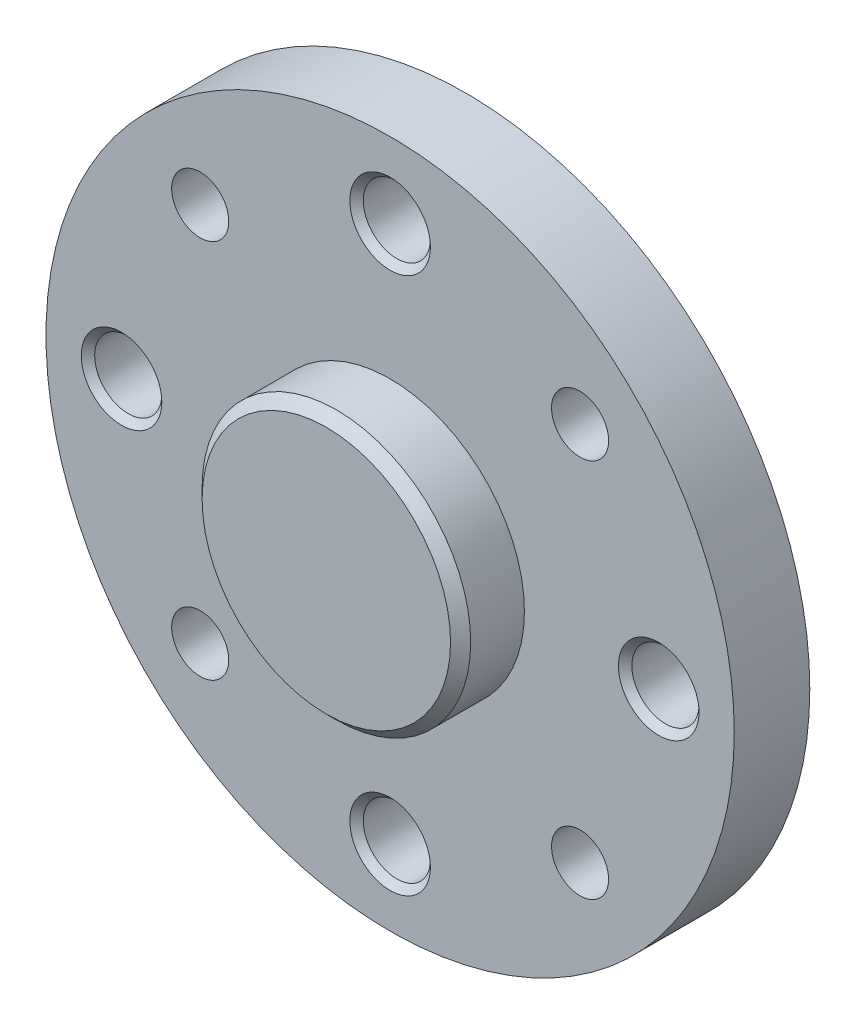
ISO-10303-21;
HEADER;
FILE_DESCRIPTION(('STEP AP214'),'2;1');
FILE_NAME('part.step','',(''),(''),'','','');
FILE_SCHEMA(('AUTOMOTIVE_DESIGN { 1 0 10303 214 1 1 1 1 }'));
ENDSEC;
DATA;
#1=APPLICATION_CONTEXT('core data for automotive mechanical design processes');
#2=APPLICATION_PROTOCOL_DEFINITION('international standard','automotive_design',2000,#1);
#3=PRODUCT_CONTEXT('',#1,'mechanical');
#4=PRODUCT('Part','Part','',(#3));
#5=PRODUCT_RELATED_PRODUCT_CATEGORY('part','',(#4));
#6=PRODUCT_DEFINITION_FORMATION('','',#4);
#7=PRODUCT_DEFINITION_CONTEXT('part definition',#1,'design');
#8=PRODUCT_DEFINITION('design','',#6,#7);
#9=PRODUCT_DEFINITION_SHAPE('','',#8);
#10=(LENGTH_UNIT() NAMED_UNIT(*) SI_UNIT(.MILLI.,.METRE.));
#11=(NAMED_UNIT(*) PLANE_ANGLE_UNIT() SI_UNIT($,.RADIAN.));
#12=(NAMED_UNIT(*) SI_UNIT($,.STERADIAN.) SOLID_ANGLE_UNIT());
#13=UNCERTAINTY_MEASURE_WITH_UNIT(LENGTH_MEASURE(1.E-05),#10,'distance_accuracy_value','');
#14=(GEOMETRIC_REPRESENTATION_CONTEXT(3) GLOBAL_UNCERTAINTY_ASSIGNED_CONTEXT((#13)) GLOBAL_UNIT_ASSIGNED_CONTEXT((#10,
#11,#12)) REPRESENTATION_CONTEXT('',''));
#15=CARTESIAN_POINT('',(0.,0.,0.));
#16=DIRECTION('',(0.,0.,1.));
#17=DIRECTION('',(1.,0.,0.));
#18=AXIS2_PLACEMENT_3D('',#15,#16,#17);
#19=CARTESIAN_POINT('',(-11.,4.75,16.75));
#20=DIRECTION('',(0.,0.,1.));
#21=DIRECTION('',(1.,0.,0.));
#22=AXIS2_PLACEMENT_3D('',#19,#20,#21);
#23=PLANE('',#22);
#24=CARTESIAN_POINT('',(-8.,0.,16.75));
#25=DIRECTION('',(0.,0.,1.));
#26=DIRECTION('',(1.,0.,0.));
#27=AXIS2_PLACEMENT_3D('',#24,#25,#26);
#28=CIRCLE('',#27,1.);
#29=CARTESIAN_POINT('',(-7.,0.,16.75));
#30=VERTEX_POINT('',#29);
#31=EDGE_CURVE('E43',#30,#30,#28,.F.);
#32=ORIENTED_EDGE('',*,*,#31,.F.);
#33=EDGE_LOOP('',(#32));
#34=FACE_BOUND('',#33,.T.);
#35=CARTESIAN_POINT('',(8.,0.,16.75));
#36=DIRECTION('',(0.,0.,1.));
#37=DIRECTION('',(1.,0.,0.));
#38=AXIS2_PLACEMENT_3D('',#35,#36,#37);
#39=CIRCLE('',#38,1.);
#40=CARTESIAN_POINT('',(9.,0.,16.75));
#41=VERTEX_POINT('',#40);
#42=EDGE_CURVE('E54',#41,#41,#39,.F.);
#43=ORIENTED_EDGE('',*,*,#42,.F.);
#44=EDGE_LOOP('',(#43));
#45=FACE_BOUND('',#44,.T.);
#46=CARTESIAN_POINT('',(5.656854249492,5.656854249492,16.75));
#47=DIRECTION('',(0.,0.,1.));
#48=DIRECTION('',(1.,0.,0.));
#49=AXIS2_PLACEMENT_3D('',#46,#47,#48);
#50=CIRCLE('',#49,0.85);
#51=CARTESIAN_POINT('',(6.506854249492,5.656854249492,16.75));
#52=VERTEX_POINT('',#51);
#53=EDGE_CURVE('E51',#52,#52,#50,.F.);
#54=ORIENTED_EDGE('',*,*,#53,.F.);
#55=EDGE_LOOP('',(#54));
#56=FACE_BOUND('',#55,.T.);
#57=CARTESIAN_POINT('',(-5.656854249492,-5.656854249492,16.75));
#58=DIRECTION('',(0.,0.,1.));
#59=DIRECTION('',(1.,0.,0.));
#60=AXIS2_PLACEMENT_3D('',#57,#58,#59);
#61=CIRCLE('',#60,0.85);
#62=CARTESIAN_POINT('',(-4.806854249492,-5.656854249492,16.75));
#63=VERTEX_POINT('',#62);
#64=EDGE_CURVE('E46',#63,#63,#61,.F.);
#65=ORIENTED_EDGE('',*,*,#64,.F.);
#66=EDGE_LOOP('',(#65));
#67=FACE_BOUND('',#66,.T.);
#68=CARTESIAN_POINT('',(0.,0.,16.75));
#69=DIRECTION('',(0.,0.,1.));
#70=DIRECTION('',(1.,0.,0.));
#71=AXIS2_PLACEMENT_3D('',#68,#69,#70);
#72=CIRCLE('',#71,10.25);
#73=CARTESIAN_POINT('',(10.25,0.,16.75));
#74=VERTEX_POINT('',#73);
#75=EDGE_CURVE('E11',#74,#74,#72,.F.);
#76=ORIENTED_EDGE('',*,*,#75,.T.);
#77=EDGE_LOOP('',(#76));
#78=FACE_BOUND('',#77,.T.);
#79=CARTESIAN_POINT('',(-5.656854249492,5.656854249492,16.75));
#80=DIRECTION('',(0.,0.,1.));
#81=DIRECTION('',(1.,0.,0.));
#82=AXIS2_PLACEMENT_3D('',#79,#80,#81);
#83=CIRCLE('',#82,0.85);
#84=CARTESIAN_POINT('',(-4.806854249492,5.656854249492,16.75));
#85=VERTEX_POINT('',#84);
#86=EDGE_CURVE('E48',#85,#85,#83,.F.);
#87=ORIENTED_EDGE('',*,*,#86,.F.);
#88=EDGE_LOOP('',(#87));
#89=FACE_BOUND('',#88,.T.);
#90=CARTESIAN_POINT('',(5.656854249492,-5.656854249492,16.75));
#91=DIRECTION('',(0.,0.,1.));
#92=DIRECTION('',(1.,0.,0.));
#93=AXIS2_PLACEMENT_3D('',#90,#91,#92);
#94=CIRCLE('',#93,0.85);
#95=CARTESIAN_POINT('',(6.506854249492,-5.656854249492,16.75));
#96=VERTEX_POINT('',#95);
#97=EDGE_CURVE('E52',#96,#96,#94,.F.);
#98=ORIENTED_EDGE('',*,*,#97,.F.);
#99=EDGE_LOOP('',(#98));
#100=FACE_BOUND('',#99,.T.);
#101=CARTESIAN_POINT('',(0.,-8.,16.75));
#102=DIRECTION('',(0.,0.,1.));
#103=DIRECTION('',(1.,0.,0.));
#104=AXIS2_PLACEMENT_3D('',#101,#102,#103);
#105=CIRCLE('',#104,1.);
#106=CARTESIAN_POINT('',(1.,-8.,16.75));
#107=VERTEX_POINT('',#106);
#108=EDGE_CURVE('E55',#107,#107,#105,.F.);
#109=ORIENTED_EDGE('',*,*,#108,.F.);
#110=EDGE_LOOP('',(#109));
#111=FACE_BOUND('',#110,.T.);
#112=CARTESIAN_POINT('',(0.,8.,16.75));
#113=DIRECTION('',(0.,0.,1.));
#114=DIRECTION('',(1.,0.,0.));
#115=AXIS2_PLACEMENT_3D('',#112,#113,#114);
#116=CIRCLE('',#115,1.);
#117=CARTESIAN_POINT('',(1.,8.,16.75));
#118=VERTEX_POINT('',#117);
#119=EDGE_CURVE('E35',#118,#118,#116,.F.);
#120=ORIENTED_EDGE('',*,*,#119,.F.);
#121=EDGE_LOOP('',(#120));
#122=FACE_BOUND('',#121,.T.);
#123=ADVANCED_FACE('F32',(#34,#45,#56,#67,#78,#89,#100,#111,#122),#23,.F.);
#124=CARTESIAN_POINT('',(0.,0.,20.9));
#125=DIRECTION('',(0.,0.,1.));
#126=DIRECTION('',(1.,0.,0.));
#127=AXIS2_PLACEMENT_3D('',#124,#125,#126);
#128=PLANE('',#127);
#129=CARTESIAN_POINT('',(0.,0.,20.9000000000401));
#130=DIRECTION('',(0.,0.,-1.));
#131=DIRECTION('',(-1.,0.,0.));
#132=AXIS2_PLACEMENT_3D('',#129,#130,#131);
#133=CIRCLE('',#132,3.70000000003756);
#134=CARTESIAN_POINT('',(-3.70000000003756,0.,20.9000000000401));
#135=VERTEX_POINT('',#134);
#136=EDGE_CURVE('E98',#135,#135,#133,.T.);
#137=ORIENTED_EDGE('',*,*,#136,.F.);
#138=EDGE_LOOP('',(#137));
#139=FACE_BOUND('',#138,.T.);
#140=ADVANCED_FACE('F74',(#139),#128,.T.);
#141=CARTESIAN_POINT('',(0.,0.,20.6000000000017));
#142=DIRECTION('',(0.,0.,-1.));
#143=DIRECTION('',(-1.,0.,0.));
#144=AXIS2_PLACEMENT_3D('',#141,#142,#143);
#145=CONICAL_SURFACE('',#144,4.00000000007594,0.785398163397448);
#146=CARTESIAN_POINT('',(0.,0.,20.6));
#147=DIRECTION('',(0.,0.,1.));
#148=DIRECTION('',(1.,0.,0.));
#149=AXIS2_PLACEMENT_3D('',#146,#147,#148);
#150=CIRCLE('',#149,4.);
#151=CARTESIAN_POINT('',(4.,0.,20.6));
#152=VERTEX_POINT('',#151);
#153=EDGE_CURVE('E135',#152,#152,#150,.F.);
#154=ORIENTED_EDGE('',*,*,#153,.F.);
#155=EDGE_LOOP('',(#154));
#156=FACE_BOUND('',#155,.T.);
#157=ORIENTED_EDGE('',*,*,#136,.T.);
#158=EDGE_LOOP('',(#157));
#159=FACE_BOUND('',#158,.T.);
#160=ADVANCED_FACE('F201',(#156,#159),#145,.T.);
#161=CARTESIAN_POINT('',(0.,8.,19.0000000000055));
#162=DIRECTION('',(0.,0.,1.));
#163=DIRECTION('',(1.,0.,0.));
#164=AXIS2_PLACEMENT_3D('',#161,#162,#163);
#165=CONICAL_SURFACE('',#164,1.19999999994479,0.785398163397448);
#166=CARTESIAN_POINT('',(0.,8.,18.7999999999988));
#167=DIRECTION('',(0.,0.,1.));
#168=DIRECTION('',(0.,-1.,0.));
#169=AXIS2_PLACEMENT_3D('',#166,#167,#168);
#170=CIRCLE('',#169,0.999999999938155);
#171=CARTESIAN_POINT('',(0.,7.00000000006185,18.7999999999988));
#172=VERTEX_POINT('',#171);
#173=EDGE_CURVE('E95',#172,#172,#170,.T.);
#174=ORIENTED_EDGE('',*,*,#173,.F.);
#175=EDGE_LOOP('',(#174));
#176=FACE_BOUND('',#175,.T.);
#177=CARTESIAN_POINT('',(0.,8.,18.9999999999868));
#178=DIRECTION('',(0.,0.,1.));
#179=DIRECTION('',(1.,0.,0.));
#180=AXIS2_PLACEMENT_3D('',#177,#178,#179);
#181=CIRCLE('',#180,1.19999999992615);
#182=CARTESIAN_POINT('',(1.19999999992614,8.,18.9999999999868));
#183=VERTEX_POINT('',#182);
#184=EDGE_CURVE('E133',#183,#183,#181,.F.);
#185=ORIENTED_EDGE('',*,*,#184,.F.);
#186=EDGE_LOOP('',(#185));
#187=FACE_BOUND('',#186,.T.);
#188=ADVANCED_FACE('F91',(#176,#187),#165,.F.);
#189=CARTESIAN_POINT('',(0.,8.,19.));
#190=DIRECTION('',(0.,0.,1.));
#191=DIRECTION('',(1.,0.,0.));
#192=AXIS2_PLACEMENT_3D('',#189,#190,#191);
#193=CYLINDRICAL_SURFACE('',#192,1.);
#194=ORIENTED_EDGE('',*,*,#119,.T.);
#195=EDGE_LOOP('',(#194));
#196=FACE_BOUND('',#195,.T.);
#197=ORIENTED_EDGE('',*,*,#173,.T.);
#198=EDGE_LOOP('',(#197));
#199=FACE_BOUND('',#198,.T.);
#200=ADVANCED_FACE('F87',(#196,#199),#193,.F.);
#201=CARTESIAN_POINT('',(-8.,0.,19.0000000000055));
#202=DIRECTION('',(0.,0.,1.));
#203=DIRECTION('',(1.,0.,0.));
#204=AXIS2_PLACEMENT_3D('',#201,#202,#203);
#205=CONICAL_SURFACE('',#204,1.19999999992615,0.785398163397448);
#206=CARTESIAN_POINT('',(-8.,0.,18.8000000000557));
#207=DIRECTION('',(0.,0.,1.));
#208=DIRECTION('',(0.,-1.,0.));
#209=AXIS2_PLACEMENT_3D('',#206,#207,#208);
#210=CIRCLE('',#209,0.999999999976353);
#211=CARTESIAN_POINT('',(-8.,-0.999999999976353,18.8000000000557));
#212=VERTEX_POINT('',#211);
#213=EDGE_CURVE('E97',#212,#212,#210,.T.);
#214=ORIENTED_EDGE('',*,*,#213,.F.);
#215=EDGE_LOOP('',(#214));
#216=FACE_BOUND('',#215,.T.);
#217=CARTESIAN_POINT('',(-8.,0.,19.0000000000055));
#218=DIRECTION('',(0.,0.,1.));
#219=DIRECTION('',(1.,0.,0.));
#220=AXIS2_PLACEMENT_3D('',#217,#218,#219);
#221=CIRCLE('',#220,1.19999999992615);
#222=CARTESIAN_POINT('',(-6.80000000007385,0.,19.0000000000055));
#223=VERTEX_POINT('',#222);
#224=EDGE_CURVE('E130',#223,#223,#221,.F.);
#225=ORIENTED_EDGE('',*,*,#224,.F.);
#226=EDGE_LOOP('',(#225));
#227=FACE_BOUND('',#226,.T.);
#228=ADVANCED_FACE('F90',(#216,#227),#205,.F.);
#229=CARTESIAN_POINT('',(-8.,0.,19.));
#230=DIRECTION('',(0.,0.,1.));
#231=DIRECTION('',(1.,0.,0.));
#232=AXIS2_PLACEMENT_3D('',#229,#230,#231);
#233=CYLINDRICAL_SURFACE('',#232,1.);
#234=ORIENTED_EDGE('',*,*,#31,.T.);
#235=EDGE_LOOP('',(#234));
#236=FACE_BOUND('',#235,.T.);
#237=ORIENTED_EDGE('',*,*,#213,.T.);
#238=EDGE_LOOP('',(#237));
#239=FACE_BOUND('',#238,.T.);
#240=ADVANCED_FACE('F153',(#236,#239),#233,.F.);
#241=CARTESIAN_POINT('',(0.,-8.,19.0000000000055));
#242=DIRECTION('',(0.,0.,1.));
#243=DIRECTION('',(1.,0.,0.));
#244=AXIS2_PLACEMENT_3D('',#241,#242,#243);
#245=CONICAL_SURFACE('',#244,1.20000000002119,0.785398163539557);
#246=CARTESIAN_POINT('',(0.,-8.,18.7999999999988));
#247=DIRECTION('',(0.,0.,1.));
#248=DIRECTION('',(0.,-1.,0.));
#249=AXIS2_PLACEMENT_3D('',#246,#247,#248);
#250=CIRCLE('',#249,0.999999999957708);
#251=CARTESIAN_POINT('',(0.,-8.99999999995771,18.7999999999988));
#252=VERTEX_POINT('',#251);
#253=EDGE_CURVE('E101',#252,#252,#250,.T.);
#254=ORIENTED_EDGE('',*,*,#253,.F.);
#255=EDGE_LOOP('',(#254));
#256=FACE_BOUND('',#255,.T.);
#257=CARTESIAN_POINT('',(0.,-8.,19.0000000000241));
#258=DIRECTION('',(0.,0.,1.));
#259=DIRECTION('',(1.,0.,0.));
#260=AXIS2_PLACEMENT_3D('',#257,#258,#259);
#261=CIRCLE('',#260,1.20000000003984);
#262=CARTESIAN_POINT('',(1.20000000003984,-8.,19.0000000000241));
#263=VERTEX_POINT('',#262);
#264=EDGE_CURVE('E127',#263,#263,#261,.F.);
#265=ORIENTED_EDGE('',*,*,#264,.F.);
#266=EDGE_LOOP('',(#265));
#267=FACE_BOUND('',#266,.T.);
#268=ADVANCED_FACE('F150',(#256,#267),#245,.F.);
#269=CARTESIAN_POINT('',(0.,-8.,19.));
#270=DIRECTION('',(0.,0.,1.));
#271=DIRECTION('',(1.,0.,0.));
#272=AXIS2_PLACEMENT_3D('',#269,#270,#271);
#273=CYLINDRICAL_SURFACE('',#272,1.);
#274=ORIENTED_EDGE('',*,*,#108,.T.);
#275=EDGE_LOOP('',(#274));
#276=FACE_BOUND('',#275,.T.);
#277=ORIENTED_EDGE('',*,*,#253,.T.);
#278=EDGE_LOOP('',(#277));
#279=FACE_BOUND('',#278,.T.);
#280=ADVANCED_FACE('F148',(#276,#279),#273,.F.);
#281=CARTESIAN_POINT('',(8.,0.,19.0000000000055));
#282=DIRECTION('',(0.,0.,1.));
#283=DIRECTION('',(1.,0.,0.));
#284=AXIS2_PLACEMENT_3D('',#281,#282,#283);
#285=CONICAL_SURFACE('',#284,1.19999999992615,0.785398163397448);
#286=CARTESIAN_POINT('',(8.,0.,18.8000000000557));
#287=DIRECTION('',(0.,0.,1.));
#288=DIRECTION('',(0.,-1.,0.));
#289=AXIS2_PLACEMENT_3D('',#286,#287,#288);
#290=CIRCLE('',#289,0.999999999976353);
#291=CARTESIAN_POINT('',(8.,-0.999999999976353,18.8000000000557));
#292=VERTEX_POINT('',#291);
#293=EDGE_CURVE('E139',#292,#292,#290,.T.);
#294=ORIENTED_EDGE('',*,*,#293,.F.);
#295=EDGE_LOOP('',(#294));
#296=FACE_BOUND('',#295,.T.);
#297=CARTESIAN_POINT('',(8.,0.,19.0000000000055));
#298=DIRECTION('',(0.,0.,1.));
#299=DIRECTION('',(1.,0.,0.));
#300=AXIS2_PLACEMENT_3D('',#297,#298,#299);
#301=CIRCLE('',#300,1.19999999992615);
#302=CARTESIAN_POINT('',(9.19999999992615,0.,19.0000000000055));
#303=VERTEX_POINT('',#302);
#304=EDGE_CURVE('E124',#303,#303,#301,.F.);
#305=ORIENTED_EDGE('',*,*,#304,.F.);
#306=EDGE_LOOP('',(#305));
#307=FACE_BOUND('',#306,.T.);
#308=ADVANCED_FACE('F192',(#296,#307),#285,.F.);
#309=CARTESIAN_POINT('',(8.,0.,19.));
#310=DIRECTION('',(0.,0.,1.));
#311=DIRECTION('',(1.,0.,0.));
#312=AXIS2_PLACEMENT_3D('',#309,#310,#311);
#313=CYLINDRICAL_SURFACE('',#312,1.);
#314=ORIENTED_EDGE('',*,*,#42,.T.);
#315=EDGE_LOOP('',(#314));
#316=FACE_BOUND('',#315,.T.);
#317=ORIENTED_EDGE('',*,*,#293,.T.);
#318=EDGE_LOOP('',(#317));
#319=FACE_BOUND('',#318,.T.);
#320=ADVANCED_FACE('F181',(#316,#319),#313,.F.);
#321=CARTESIAN_POINT('',(0.,0.,19.));
#322=DIRECTION('',(0.,0.,1.));
#323=DIRECTION('',(1.,0.,0.));
#324=AXIS2_PLACEMENT_3D('',#321,#322,#323);
#325=CYLINDRICAL_SURFACE('',#324,4.);
#326=CARTESIAN_POINT('',(0.,0.,19.));
#327=DIRECTION('',(0.,0.,1.));
#328=DIRECTION('',(1.,0.,0.));
#329=AXIS2_PLACEMENT_3D('',#326,#327,#328);
#330=CIRCLE('',#329,4.);
#331=CARTESIAN_POINT('',(4.,0.,19.));
#332=VERTEX_POINT('',#331);
#333=EDGE_CURVE('E109',#332,#332,#330,.F.);
#334=ORIENTED_EDGE('',*,*,#333,.F.);
#335=EDGE_LOOP('',(#334));
#336=FACE_BOUND('',#335,.T.);
#337=ORIENTED_EDGE('',*,*,#153,.T.);
#338=EDGE_LOOP('',(#337));
#339=FACE_BOUND('',#338,.T.);
#340=ADVANCED_FACE('F161',(#336,#339),#325,.T.);
#341=CARTESIAN_POINT('',(0.,0.,19.));
#342=DIRECTION('',(0.,0.,1.));
#343=DIRECTION('',(1.,0.,0.));
#344=AXIS2_PLACEMENT_3D('',#341,#342,#343);
#345=PLANE('',#344);
#346=ORIENTED_EDGE('',*,*,#333,.T.);
#347=EDGE_LOOP('',(#346));
#348=FACE_BOUND('',#347,.T.);
#349=CARTESIAN_POINT('',(-5.656854249492,-5.656854249492,19.));
#350=DIRECTION('',(0.,0.,1.));
#351=DIRECTION('',(1.,0.,0.));
#352=AXIS2_PLACEMENT_3D('',#349,#350,#351);
#353=CIRCLE('',#352,0.85);
#354=CARTESIAN_POINT('',(-4.806854249492,-5.656854249492,19.));
#355=VERTEX_POINT('',#354);
#356=EDGE_CURVE('E112',#355,#355,#353,.F.);
#357=ORIENTED_EDGE('',*,*,#356,.T.);
#358=EDGE_LOOP('',(#357));
#359=FACE_BOUND('',#358,.T.);
#360=CARTESIAN_POINT('',(-5.656854249492,5.656854249492,19.));
#361=DIRECTION('',(0.,0.,1.));
#362=DIRECTION('',(1.,0.,0.));
#363=AXIS2_PLACEMENT_3D('',#360,#361,#362);
#364=CIRCLE('',#363,0.85);
#365=CARTESIAN_POINT('',(-4.806854249492,5.656854249492,19.));
#366=VERTEX_POINT('',#365);
#367=EDGE_CURVE('E115',#366,#366,#364,.F.);
#368=ORIENTED_EDGE('',*,*,#367,.T.);
#369=EDGE_LOOP('',(#368));
#370=FACE_BOUND('',#369,.T.);
#371=CARTESIAN_POINT('',(5.656854249492,5.656854249492,19.));
#372=DIRECTION('',(0.,0.,1.));
#373=DIRECTION('',(1.,0.,0.));
#374=AXIS2_PLACEMENT_3D('',#371,#372,#373);
#375=CIRCLE('',#374,0.85);
#376=CARTESIAN_POINT('',(6.506854249492,5.656854249492,19.));
#377=VERTEX_POINT('',#376);
#378=EDGE_CURVE('E118',#377,#377,#375,.F.);
#379=ORIENTED_EDGE('',*,*,#378,.T.);
#380=EDGE_LOOP('',(#379));
#381=FACE_BOUND('',#380,.T.);
#382=CARTESIAN_POINT('',(5.656854249492,-5.656854249492,19.));
#383=DIRECTION('',(0.,0.,1.));
#384=DIRECTION('',(1.,0.,0.));
#385=AXIS2_PLACEMENT_3D('',#382,#383,#384);
#386=CIRCLE('',#385,0.85);
#387=CARTESIAN_POINT('',(6.506854249492,-5.656854249492,19.));
#388=VERTEX_POINT('',#387);
#389=EDGE_CURVE('E121',#388,#388,#386,.F.);
#390=ORIENTED_EDGE('',*,*,#389,.T.);
#391=EDGE_LOOP('',(#390));
#392=FACE_BOUND('',#391,.T.);
#393=ORIENTED_EDGE('',*,*,#304,.T.);
#394=EDGE_LOOP('',(#393));
#395=FACE_BOUND('',#394,.T.);
#396=ORIENTED_EDGE('',*,*,#264,.T.);
#397=EDGE_LOOP('',(#396));
#398=FACE_BOUND('',#397,.T.);
#399=ORIENTED_EDGE('',*,*,#224,.T.);
#400=EDGE_LOOP('',(#399));
#401=FACE_BOUND('',#400,.T.);
#402=ORIENTED_EDGE('',*,*,#184,.T.);
#403=EDGE_LOOP('',(#402));
#404=FACE_BOUND('',#403,.T.);
#405=CARTESIAN_POINT('',(0.,0.,19.));
#406=DIRECTION('',(0.,0.,1.));
#407=DIRECTION('',(1.,0.,0.));
#408=AXIS2_PLACEMENT_3D('',#405,#406,#407);
#409=CIRCLE('',#408,10.25);
#410=CARTESIAN_POINT('',(10.25,0.,19.));
#411=VERTEX_POINT('',#410);
#412=EDGE_CURVE('E106',#411,#411,#409,.F.);
#413=ORIENTED_EDGE('',*,*,#412,.F.);
#414=EDGE_LOOP('',(#413));
#415=FACE_BOUND('',#414,.T.);
#416=ADVANCED_FACE('F157',(#348,#359,#370,#381,#392,#395,#398,#401,#404,#415),#345,.T.);
#417=CARTESIAN_POINT('',(0.,0.,15.5));
#418=DIRECTION('',(0.,0.,1.));
#419=DIRECTION('',(1.,0.,0.));
#420=AXIS2_PLACEMENT_3D('',#417,#418,#419);
#421=CYLINDRICAL_SURFACE('',#420,10.25);
#422=ORIENTED_EDGE('',*,*,#75,.F.);
#423=EDGE_LOOP('',(#422));
#424=FACE_BOUND('',#423,.T.);
#425=ORIENTED_EDGE('',*,*,#412,.T.);
#426=EDGE_LOOP('',(#425));
#427=FACE_BOUND('',#426,.T.);
#428=ADVANCED_FACE('F160',(#424,#427),#421,.T.);
#429=CARTESIAN_POINT('',(-5.656854249492,-5.656854249492,19.));
#430=DIRECTION('',(0.,0.,1.));
#431=DIRECTION('',(1.,0.,0.));
#432=AXIS2_PLACEMENT_3D('',#429,#430,#431);
#433=CYLINDRICAL_SURFACE('',#432,0.85);
#434=ORIENTED_EDGE('',*,*,#64,.T.);
#435=EDGE_LOOP('',(#434));
#436=FACE_BOUND('',#435,.T.);
#437=ORIENTED_EDGE('',*,*,#356,.F.);
#438=EDGE_LOOP('',(#437));
#439=FACE_BOUND('',#438,.T.);
#440=ADVANCED_FACE('F169',(#436,#439),#433,.F.);
#441=CARTESIAN_POINT('',(-5.656854249492,5.656854249492,19.));
#442=DIRECTION('',(0.,0.,1.));
#443=DIRECTION('',(1.,0.,0.));
#444=AXIS2_PLACEMENT_3D('',#441,#442,#443);
#445=CYLINDRICAL_SURFACE('',#444,0.85);
#446=ORIENTED_EDGE('',*,*,#86,.T.);
#447=EDGE_LOOP('',(#446));
#448=FACE_BOUND('',#447,.T.);
#449=ORIENTED_EDGE('',*,*,#367,.F.);
#450=EDGE_LOOP('',(#449));
#451=FACE_BOUND('',#450,.T.);
#452=ADVANCED_FACE('F176',(#448,#451),#445,.F.);
#453=CARTESIAN_POINT('',(5.656854249492,5.656854249492,19.));
#454=DIRECTION('',(0.,0.,1.));
#455=DIRECTION('',(1.,0.,0.));
#456=AXIS2_PLACEMENT_3D('',#453,#454,#455);
#457=CYLINDRICAL_SURFACE('',#456,0.85);
#458=ORIENTED_EDGE('',*,*,#53,.T.);
#459=EDGE_LOOP('',(#458));
#460=FACE_BOUND('',#459,.T.);
#461=ORIENTED_EDGE('',*,*,#378,.F.);
#462=EDGE_LOOP('',(#461));
#463=FACE_BOUND('',#462,.T.);
#464=ADVANCED_FACE('F69',(#460,#463),#457,.F.);
#465=CARTESIAN_POINT('',(5.656854249492,-5.656854249492,19.));
#466=DIRECTION('',(0.,0.,1.));
#467=DIRECTION('',(1.,0.,0.));
#468=AXIS2_PLACEMENT_3D('',#465,#466,#467);
#469=CYLINDRICAL_SURFACE('',#468,0.85);
#470=ORIENTED_EDGE('',*,*,#97,.T.);
#471=EDGE_LOOP('',(#470));
#472=FACE_BOUND('',#471,.T.);
#473=ORIENTED_EDGE('',*,*,#389,.F.);
#474=EDGE_LOOP('',(#473));
#475=FACE_BOUND('',#474,.T.);
#476=ADVANCED_FACE('F76',(#472,#475),#469,.F.);
#477=CLOSED_SHELL('',(#123,#140,#160,#188,#200,#228,#240,#268,#280,#308,#320,#340,#416,#428,
#440,#452,#464,#476));
#478=MANIFOLD_SOLID_BREP('B2',#477);
#479=ADVANCED_BREP_SHAPE_REPRESENTATION('',(#18,#478),#14);
#480=SHAPE_DEFINITION_REPRESENTATION(#9,#479);
ENDSEC;
END-ISO-10303-21;
